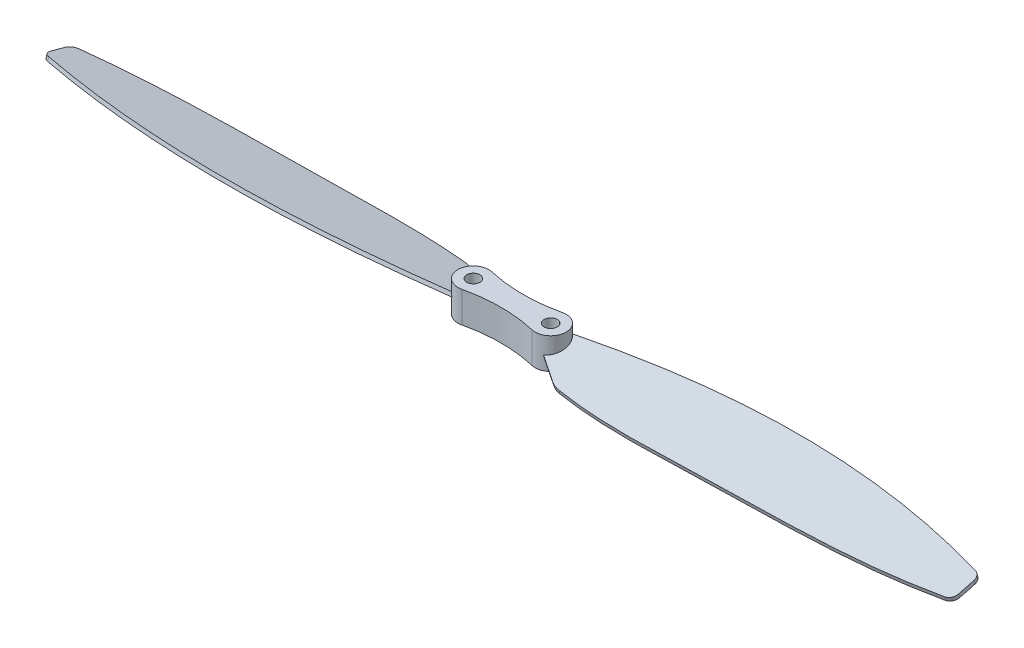
ISO-10303-21;
HEADER;
FILE_DESCRIPTION(('STEP AP214'),'2;1');
FILE_NAME('part.step','',(''),(''),'','','');
FILE_SCHEMA(('AUTOMOTIVE_DESIGN { 1 0 10303 214 1 1 1 1 }'));
ENDSEC;
DATA;
#1=APPLICATION_CONTEXT('core data for automotive mechanical design processes');
#2=APPLICATION_PROTOCOL_DEFINITION('international standard','automotive_design',2000,#1);
#3=PRODUCT_CONTEXT('',#1,'mechanical');
#4=PRODUCT('Part','Part','',(#3));
#5=PRODUCT_RELATED_PRODUCT_CATEGORY('part','',(#4));
#6=PRODUCT_DEFINITION_FORMATION('','',#4);
#7=PRODUCT_DEFINITION_CONTEXT('part definition',#1,'design');
#8=PRODUCT_DEFINITION('design','',#6,#7);
#9=PRODUCT_DEFINITION_SHAPE('','',#8);
#10=(LENGTH_UNIT() NAMED_UNIT(*) SI_UNIT(.MILLI.,.METRE.));
#11=(NAMED_UNIT(*) PLANE_ANGLE_UNIT() SI_UNIT($,.RADIAN.));
#12=(NAMED_UNIT(*) SI_UNIT($,.STERADIAN.) SOLID_ANGLE_UNIT());
#13=UNCERTAINTY_MEASURE_WITH_UNIT(LENGTH_MEASURE(1.E-05),#10,'distance_accuracy_value','');
#14=(GEOMETRIC_REPRESENTATION_CONTEXT(3) GLOBAL_UNCERTAINTY_ASSIGNED_CONTEXT((#13)) GLOBAL_UNIT_ASSIGNED_CONTEXT((#10,
#11,#12)) REPRESENTATION_CONTEXT('',''));
#15=CARTESIAN_POINT('',(0.,0.,0.));
#16=DIRECTION('',(0.,0.,1.));
#17=DIRECTION('',(1.,0.,0.));
#18=AXIS2_PLACEMENT_3D('',#15,#16,#17);
#19=CARTESIAN_POINT('',(-5.,4.,0.));
#20=DIRECTION('',(0.,-1.,0.));
#21=DIRECTION('',(0.,0.,-1.));
#22=AXIS2_PLACEMENT_3D('',#19,#20,#21);
#23=CYLINDRICAL_SURFACE('',#22,2.);
#24=CARTESIAN_POINT('',(-5.,0.,0.));
#25=DIRECTION('',(0.,1.,0.));
#26=DIRECTION('',(0.,0.,1.));
#27=AXIS2_PLACEMENT_3D('',#24,#25,#26);
#28=CIRCLE('',#27,2.);
#29=CARTESIAN_POINT('',(-4.54545454545454,0.,-1.9476622986935));
#30=VERTEX_POINT('',#29);
#31=CARTESIAN_POINT('',(-4.54545454545454,0.,1.9476622986935));
#32=VERTEX_POINT('',#31);
#33=EDGE_CURVE('E644',#30,#32,#28,.T.);
#34=ORIENTED_EDGE('',*,*,#33,.T.);
#35=DIRECTION('',(0.,-1.,0.));
#36=VECTOR('',#35,1.);
#37=CARTESIAN_POINT('',(-4.54545454545454,4.,1.9476622986935));
#38=LINE('',#37,#36);
#39=CARTESIAN_POINT('',(-4.54545454545454,4.,1.9476622986935));
#40=VERTEX_POINT('',#39);
#41=EDGE_CURVE('E660',#40,#32,#38,.T.);
#42=ORIENTED_EDGE('',*,*,#41,.F.);
#43=CARTESIAN_POINT('',(-5.,4.,0.));
#44=DIRECTION('',(0.,1.,0.));
#45=DIRECTION('',(0.,0.,1.));
#46=AXIS2_PLACEMENT_3D('',#43,#44,#45);
#47=CIRCLE('',#46,2.);
#48=CARTESIAN_POINT('',(-4.54545454545454,4.,-1.9476622986935));
#49=VERTEX_POINT('',#48);
#50=EDGE_CURVE('E641',#49,#40,#47,.T.);
#51=ORIENTED_EDGE('',*,*,#50,.F.);
#52=DIRECTION('',(0.,-1.,0.));
#53=VECTOR('',#52,1.);
#54=CARTESIAN_POINT('',(-4.54545454545454,4.,-1.9476622986935));
#55=LINE('',#54,#53);
#56=EDGE_CURVE('E656',#49,#30,#55,.T.);
#57=ORIENTED_EDGE('',*,*,#56,.T.);
#58=EDGE_LOOP('',(#34,#42,#51,#57));
#59=FACE_BOUND('',#58,.T.);
#60=CARTESIAN_POINT('',(-5.,1.74118095489748,0.));
#61=DIRECTION('',(0.,0.965925826289068,-0.258819045102522));
#62=DIRECTION('',(0.,-0.258819045102522,-0.965925826289068));
#63=AXIS2_PLACEMENT_3D('',#60,#61,#62);
#64=ELLIPSE('',#63,2.07055236082017,2.);
#65=CARTESIAN_POINT('',(-5.98774586559362,1.27519904277076,-1.73906817146503));
#66=VERTEX_POINT('',#65);
#67=CARTESIAN_POINT('',(-6.13282358889657,2.18282680138113,1.64824473802876));
#68=VERTEX_POINT('',#67);
#69=EDGE_CURVE('E11',#66,#68,#64,.T.);
#70=ORIENTED_EDGE('',*,*,#69,.F.);
#71=CARTESIAN_POINT('',(-5.,-2.78582998323562,0.));
#72=DIRECTION('',(-0.536981051107588,0.218338272370165,0.814849525722266));
#73=DIRECTION('',(-0.120142167420169,-0.975873146888678,0.182311438997044));
#74=AXIS2_PLACEMENT_3D('',#71,#72,#73);
#75=ELLIPSE('',#74,9.16009812796013,2.);
#76=CARTESIAN_POINT('',(-5.87434697016372,1.77684425741397,-1.79875439562091));
#77=VERTEX_POINT('',#76);
#78=EDGE_CURVE('E257',#77,#66,#75,.T.);
#79=ORIENTED_EDGE('',*,*,#78,.F.);
#80=CARTESIAN_POINT('',(-5.,2.25881904510252,0.));
#81=DIRECTION('',(0.,0.965925826289068,-0.258819045102522));
#82=DIRECTION('',(0.,-0.258819045102522,-0.965925826289068));
#83=AXIS2_PLACEMENT_3D('',#80,#81,#82);
#84=ELLIPSE('',#83,2.07055236082017,2.);
#85=CARTESIAN_POINT('',(-6.27033577564308,2.67273307916517,1.54474820508758));
#86=VERTEX_POINT('',#85);
#87=EDGE_CURVE('E750',#77,#86,#84,.T.);
#88=ORIENTED_EDGE('',*,*,#87,.T.);
#89=CARTESIAN_POINT('',(-6.13282358889657,2.18282680138114,1.64824473802876));
#90=CARTESIAN_POINT('',(-6.14506501810099,2.22347372736233,1.63983094072677));
#91=CARTESIAN_POINT('',(-6.15709835862117,2.26417127418118,1.63136011112619));
#92=CARTESIAN_POINT('',(-6.18076721990072,2.34565565178746,1.6143115509723));
#93=CARTESIAN_POINT('',(-6.19240277469154,2.38644247461787,1.60573382964993));
#94=CARTESIAN_POINT('',(-6.21529649060534,2.4681003337165,1.5884772228464));
#95=CARTESIAN_POINT('',(-6.2265546525425,2.50897136980283,1.57979833758355));
#96=CARTESIAN_POINT('',(-6.2487111845599,2.59079424338632,1.56234409025312));
#97=CARTESIAN_POINT('',(-6.25960952369611,2.63174608751353,1.55356871997408));
#98=CARTESIAN_POINT('',(-6.27033577564307,2.67273307916517,1.54474820508758));
#99=B_SPLINE_CURVE_WITH_KNOTS('',3,(#89,#90,#91,#92,#93,#94,#95,#96,#97,#98),.UNSPECIFIED.,.F.,
.F.,(4,2,2,2,4),(0.,0.129827276455146,0.2596434179636,0.389459279390435,0.519286275787984),.UNSPECIFIED.);
#100=EDGE_CURVE('E48',#68,#86,#99,.T.);
#101=ORIENTED_EDGE('',*,*,#100,.F.);
#102=EDGE_LOOP('',(#70,#79,#88,#101));
#103=FACE_BOUND('',#102,.T.);
#104=ADVANCED_FACE('F40',(#59,#103),#23,.T.);
#105=CARTESIAN_POINT('',(5.,4.,0.));
#106=DIRECTION('',(0.,-1.,0.));
#107=DIRECTION('',(0.,0.,-1.));
#108=AXIS2_PLACEMENT_3D('',#105,#106,#107);
#109=CYLINDRICAL_SURFACE('',#108,2.);
#110=CARTESIAN_POINT('',(5.,0.,0.));
#111=DIRECTION('',(0.,1.,0.));
#112=DIRECTION('',(0.,0.,1.));
#113=AXIS2_PLACEMENT_3D('',#110,#111,#112);
#114=CIRCLE('',#113,2.);
#115=CARTESIAN_POINT('',(4.54545454545454,0.,1.9476622986935));
#116=VERTEX_POINT('',#115);
#117=CARTESIAN_POINT('',(4.54545454545454,0.,-1.9476622986935));
#118=VERTEX_POINT('',#117);
#119=EDGE_CURVE('E666',#116,#118,#114,.T.);
#120=ORIENTED_EDGE('',*,*,#119,.T.);
#121=DIRECTION('',(0.,-1.,0.));
#122=VECTOR('',#121,1.);
#123=CARTESIAN_POINT('',(4.54545454545454,4.,-1.9476622986935));
#124=LINE('',#123,#122);
#125=CARTESIAN_POINT('',(4.54545454545454,4.,-1.9476622986935));
#126=VERTEX_POINT('',#125);
#127=EDGE_CURVE('E653',#126,#118,#124,.T.);
#128=ORIENTED_EDGE('',*,*,#127,.F.);
#129=CARTESIAN_POINT('',(5.,4.,0.));
#130=DIRECTION('',(0.,1.,0.));
#131=DIRECTION('',(0.,0.,1.));
#132=AXIS2_PLACEMENT_3D('',#129,#130,#131);
#133=CIRCLE('',#132,2.);
#134=CARTESIAN_POINT('',(4.54545454545454,4.,1.9476622986935));
#135=VERTEX_POINT('',#134);
#136=EDGE_CURVE('E638',#135,#126,#133,.T.);
#137=ORIENTED_EDGE('',*,*,#136,.F.);
#138=DIRECTION('',(0.,-1.,0.));
#139=VECTOR('',#138,1.);
#140=CARTESIAN_POINT('',(4.54545454545454,4.,1.9476622986935));
#141=LINE('',#140,#139);
#142=EDGE_CURVE('E648',#135,#116,#141,.T.);
#143=ORIENTED_EDGE('',*,*,#142,.T.);
#144=EDGE_LOOP('',(#120,#128,#137,#143));
#145=FACE_BOUND('',#144,.T.);
#146=CARTESIAN_POINT('',(5.,1.74118095489748,0.));
#147=DIRECTION('',(0.,0.965925826289068,0.258819045102522));
#148=DIRECTION('',(0.,-0.258819045102522,0.965925826289068));
#149=AXIS2_PLACEMENT_3D('',#146,#147,#148);
#150=ELLIPSE('',#149,2.07055236082017,2.);
#151=CARTESIAN_POINT('',(5.98774586559362,1.27519904277076,1.73906817146503));
#152=VERTEX_POINT('',#151);
#153=CARTESIAN_POINT('',(6.13282358889657,2.18282680138113,-1.64824473802876));
#154=VERTEX_POINT('',#153);
#155=EDGE_CURVE('E235',#152,#154,#150,.T.);
#156=ORIENTED_EDGE('',*,*,#155,.F.);
#157=CARTESIAN_POINT('',(5.,-2.78582998323562,0.));
#158=DIRECTION('',(0.536981051107588,0.218338272370165,-0.814849525722266));
#159=DIRECTION('',(0.120142167420169,-0.975873146888678,-0.182311438997044));
#160=AXIS2_PLACEMENT_3D('',#157,#158,#159);
#161=ELLIPSE('',#160,9.16009812796013,2.);
#162=CARTESIAN_POINT('',(5.87434697016372,1.77684425741397,1.79875439562091));
#163=VERTEX_POINT('',#162);
#164=EDGE_CURVE('E236',#163,#152,#161,.T.);
#165=ORIENTED_EDGE('',*,*,#164,.F.);
#166=CARTESIAN_POINT('',(5.,2.25881904510252,0.));
#167=DIRECTION('',(0.,0.965925826289068,0.258819045102522));
#168=DIRECTION('',(0.,-0.258819045102522,0.965925826289068));
#169=AXIS2_PLACEMENT_3D('',#166,#167,#168);
#170=ELLIPSE('',#169,2.07055236082017,2.);
#171=CARTESIAN_POINT('',(6.27033577564308,2.67273307916517,-1.54474820508758));
#172=VERTEX_POINT('',#171);
#173=EDGE_CURVE('E652',#163,#172,#170,.T.);
#174=ORIENTED_EDGE('',*,*,#173,.T.);
#175=CARTESIAN_POINT('',(6.13282358889657,2.18282680138114,-1.64824473802876));
#176=CARTESIAN_POINT('',(6.14506501810099,2.22347372736233,-1.63983094072677));
#177=CARTESIAN_POINT('',(6.15709835862117,2.26417127418118,-1.63136011112619));
#178=CARTESIAN_POINT('',(6.18076721990072,2.34565565178746,-1.6143115509723));
#179=CARTESIAN_POINT('',(6.19240277469154,2.38644247461787,-1.60573382964993));
#180=CARTESIAN_POINT('',(6.21529649060534,2.4681003337165,-1.5884772228464));
#181=CARTESIAN_POINT('',(6.2265546525425,2.50897136980283,-1.57979833758355));
#182=CARTESIAN_POINT('',(6.2487111845599,2.59079424338632,-1.56234409025312));
#183=CARTESIAN_POINT('',(6.25960952369611,2.63174608751353,-1.55356871997408));
#184=CARTESIAN_POINT('',(6.27033577564307,2.67273307916517,-1.54474820508758));
#185=B_SPLINE_CURVE_WITH_KNOTS('',3,(#175,#176,#177,#178,#179,#180,#181,#182,#183,#184),
.UNSPECIFIED.,.F.,.F.,(4,2,2,2,4),(0.,0.129827276455146,0.2596434179636,0.389459279390435,
0.519286275787984),.UNSPECIFIED.);
#186=EDGE_CURVE('E228',#154,#172,#185,.T.);
#187=ORIENTED_EDGE('',*,*,#186,.F.);
#188=EDGE_LOOP('',(#156,#165,#174,#187));
#189=FACE_BOUND('',#188,.T.);
#190=ADVANCED_FACE('F239',(#145,#189),#109,.T.);
#191=CARTESIAN_POINT('',(0.,4.,21.4242852856285));
#192=DIRECTION('',(0.,-1.,0.));
#193=DIRECTION('',(0.,0.,-1.));
#194=AXIS2_PLACEMENT_3D('',#191,#192,#193);
#195=CYLINDRICAL_SURFACE('',#194,20.);
#196=CARTESIAN_POINT('',(0.,0.,21.4242852856285));
#197=DIRECTION('',(0.,1.,0.));
#198=DIRECTION('',(0.,0.,1.));
#199=AXIS2_PLACEMENT_3D('',#196,#197,#198);
#200=CIRCLE('',#199,20.);
#201=EDGE_CURVE('E650',#32,#116,#200,.F.);
#202=ORIENTED_EDGE('',*,*,#201,.T.);
#203=ORIENTED_EDGE('',*,*,#142,.F.);
#204=CARTESIAN_POINT('',(0.,4.,21.4242852856285));
#205=DIRECTION('',(0.,1.,0.));
#206=DIRECTION('',(0.,0.,1.));
#207=AXIS2_PLACEMENT_3D('',#204,#205,#206);
#208=CIRCLE('',#207,20.);
#209=EDGE_CURVE('E635',#40,#135,#208,.F.);
#210=ORIENTED_EDGE('',*,*,#209,.F.);
#211=ORIENTED_EDGE('',*,*,#41,.T.);
#212=EDGE_LOOP('',(#202,#203,#210,#211));
#213=FACE_BOUND('',#212,.T.);
#214=ADVANCED_FACE('F42',(#213),#195,.F.);
#215=CARTESIAN_POINT('',(0.,4.,-21.4242852856285));
#216=DIRECTION('',(0.,-1.,0.));
#217=DIRECTION('',(0.,0.,-1.));
#218=AXIS2_PLACEMENT_3D('',#215,#216,#217);
#219=CYLINDRICAL_SURFACE('',#218,20.);
#220=CARTESIAN_POINT('',(0.,0.,-21.4242852856285));
#221=DIRECTION('',(0.,1.,0.));
#222=DIRECTION('',(0.,0.,1.));
#223=AXIS2_PLACEMENT_3D('',#220,#221,#222);
#224=CIRCLE('',#223,20.);
#225=EDGE_CURVE('E663',#30,#118,#224,.T.);
#226=ORIENTED_EDGE('',*,*,#225,.F.);
#227=ORIENTED_EDGE('',*,*,#56,.F.);
#228=CARTESIAN_POINT('',(0.,4.,-21.4242852856285));
#229=DIRECTION('',(0.,1.,0.));
#230=DIRECTION('',(0.,0.,1.));
#231=AXIS2_PLACEMENT_3D('',#228,#229,#230);
#232=CIRCLE('',#231,20.);
#233=EDGE_CURVE('E671',#49,#126,#232,.T.);
#234=ORIENTED_EDGE('',*,*,#233,.T.);
#235=ORIENTED_EDGE('',*,*,#127,.T.);
#236=EDGE_LOOP('',(#226,#227,#234,#235));
#237=FACE_BOUND('',#236,.T.);
#238=ADVANCED_FACE('F244',(#237),#219,.F.);
#239=CARTESIAN_POINT('',(0.,4.,0.));
#240=DIRECTION('',(0.,1.,0.));
#241=DIRECTION('',(0.,0.,1.));
#242=AXIS2_PLACEMENT_3D('',#239,#240,#241);
#243=PLANE('',#242);
#244=CARTESIAN_POINT('',(-5.,4.,0.));
#245=DIRECTION('',(0.,1.,0.));
#246=DIRECTION('',(0.,0.,1.));
#247=AXIS2_PLACEMENT_3D('',#244,#245,#246);
#248=CIRCLE('',#247,0.85);
#249=CARTESIAN_POINT('',(-5.,4.,0.85));
#250=VERTEX_POINT('',#249);
#251=EDGE_CURVE('E360',#250,#250,#248,.T.);
#252=ORIENTED_EDGE('',*,*,#251,.F.);
#253=EDGE_LOOP('',(#252));
#254=FACE_BOUND('',#253,.T.);
#255=CARTESIAN_POINT('',(5.,4.,0.));
#256=DIRECTION('',(0.,1.,0.));
#257=DIRECTION('',(0.,0.,1.));
#258=AXIS2_PLACEMENT_3D('',#255,#256,#257);
#259=CIRCLE('',#258,0.85);
#260=CARTESIAN_POINT('',(5.,4.,0.85));
#261=VERTEX_POINT('',#260);
#262=EDGE_CURVE('E365',#261,#261,#259,.T.);
#263=ORIENTED_EDGE('',*,*,#262,.F.);
#264=EDGE_LOOP('',(#263));
#265=FACE_BOUND('',#264,.T.);
#266=ORIENTED_EDGE('',*,*,#209,.T.);
#267=ORIENTED_EDGE('',*,*,#136,.T.);
#268=ORIENTED_EDGE('',*,*,#233,.F.);
#269=ORIENTED_EDGE('',*,*,#50,.T.);
#270=EDGE_LOOP('',(#266,#267,#268,#269));
#271=FACE_BOUND('',#270,.T.);
#272=ADVANCED_FACE('F225',(#254,#265,#271),#243,.T.);
#273=CARTESIAN_POINT('',(0.,0.,0.));
#274=DIRECTION('',(0.,1.,0.));
#275=DIRECTION('',(0.,0.,1.));
#276=AXIS2_PLACEMENT_3D('',#273,#274,#275);
#277=PLANE('',#276);
#278=CARTESIAN_POINT('',(-5.,0.,0.));
#279=DIRECTION('',(0.,1.,0.));
#280=DIRECTION('',(0.,0.,1.));
#281=AXIS2_PLACEMENT_3D('',#278,#279,#280);
#282=CIRCLE('',#281,0.85);
#283=CARTESIAN_POINT('',(-5.,0.,0.85));
#284=VERTEX_POINT('',#283);
#285=EDGE_CURVE('E355',#284,#284,#282,.T.);
#286=ORIENTED_EDGE('',*,*,#285,.T.);
#287=EDGE_LOOP('',(#286));
#288=FACE_BOUND('',#287,.T.);
#289=CARTESIAN_POINT('',(5.,0.,0.));
#290=DIRECTION('',(0.,1.,0.));
#291=DIRECTION('',(0.,0.,1.));
#292=AXIS2_PLACEMENT_3D('',#289,#290,#291);
#293=CIRCLE('',#292,0.85);
#294=CARTESIAN_POINT('',(5.,0.,0.85));
#295=VERTEX_POINT('',#294);
#296=EDGE_CURVE('E270',#295,#295,#293,.T.);
#297=ORIENTED_EDGE('',*,*,#296,.T.);
#298=EDGE_LOOP('',(#297));
#299=FACE_BOUND('',#298,.T.);
#300=ORIENTED_EDGE('',*,*,#201,.F.);
#301=ORIENTED_EDGE('',*,*,#33,.F.);
#302=ORIENTED_EDGE('',*,*,#225,.T.);
#303=ORIENTED_EDGE('',*,*,#119,.F.);
#304=EDGE_LOOP('',(#300,#301,#302,#303));
#305=FACE_BOUND('',#304,.T.);
#306=ADVANCED_FACE('F222',(#288,#299,#305),#277,.F.);
#307=CARTESIAN_POINT('',(5.,2.12454394721217,-1.43073016506007));
#308=CARTESIAN_POINT('',(23.0551671465473,3.06874516411303,-4.95453707910242));
#309=CARTESIAN_POINT('',(40.7679372398161,3.2697667907803,-5.70476000324478));
#310=CARTESIAN_POINT('',(58.7391343275857,2.0933879485083,-1.31445439493665));
#311=B_SPLINE_CURVE_WITH_KNOTS('',3,(#307,#308,#309,#310),.UNSPECIFIED.,.F.,.F.,(4,4),(0.,
0.986483200621647),.UNSPECIFIED.);
#312=DIRECTION('',(0.,0.965925826289068,0.258819045102522));
#313=VECTOR('',#312,1.);
#314=SURFACE_OF_LINEAR_EXTRUSION('',#311,#313);
#315=CARTESIAN_POINT('',(58.7391343275857,2.0933879485083,-1.31445439493666));
#316=VERTEX_POINT('',#315);
#317=EDGE_CURVE('E204',#154,#316,#311,.T.);
#318=ORIENTED_EDGE('',*,*,#317,.F.);
#319=ORIENTED_EDGE('',*,*,#186,.T.);
#320=CARTESIAN_POINT('',(5.,2.60750686035671,-1.3013206425088));
#321=CARTESIAN_POINT('',(23.0551671465473,3.55170807725757,-4.82512755655116));
#322=CARTESIAN_POINT('',(40.7679372398161,3.75272970392483,-5.57535048069352));
#323=CARTESIAN_POINT('',(58.7391343275857,2.57635086165283,-1.18504487238539));
#324=B_SPLINE_CURVE_WITH_KNOTS('',3,(#320,#321,#322,#323),.UNSPECIFIED.,.F.,.F.,(4,4),(0.,
0.986483200621647),.UNSPECIFIED.);
#325=CARTESIAN_POINT('',(58.7391343275857,2.57635086165283,-1.1850448723854));
#326=VERTEX_POINT('',#325);
#327=EDGE_CURVE('E63',#172,#326,#324,.T.);
#328=ORIENTED_EDGE('',*,*,#327,.T.);
#329=DIRECTION('',(0.,0.965925826289068,0.258819045102522));
#330=VECTOR('',#329,1.);
#331=CARTESIAN_POINT('',(58.7391343275857,2.0933879485083,-1.31445439493666));
#332=LINE('',#331,#330);
#333=EDGE_CURVE('E669',#316,#326,#332,.T.);
#334=ORIENTED_EDGE('',*,*,#333,.F.);
#335=EDGE_LOOP('',(#318,#319,#328,#334));
#336=FACE_BOUND('',#335,.T.);
#337=ADVANCED_FACE('F216',(#336),#314,.F.);
#338=CARTESIAN_POINT('',(58.4939401629709,1.8424696155838,-0.378014427911937));
#339=DIRECTION('',(0.,0.965925826289068,0.258819045102522));
#340=DIRECTION('',(0.,-0.258819045102522,0.965925826289068));
#341=AXIS2_PLACEMENT_3D('',#338,#339,#340);
#342=CYLINDRICAL_SURFACE('',#341,1.);
#343=CARTESIAN_POINT('',(58.4939401629709,2.32543252872833,-0.248604905360676));
#344=DIRECTION('',(0.,-0.965925826289068,-0.258819045102522));
#345=DIRECTION('',(0.,0.258819045102522,-0.965925826289068));
#346=AXIS2_PLACEMENT_3D('',#343,#344,#345);
#347=CIRCLE('',#346,1.);
#348=CARTESIAN_POINT('',(59.4938365760131,2.3291577538287,-0.262507634704898));
#349=VERTEX_POINT('',#348);
#350=EDGE_CURVE('E198',#326,#349,#347,.T.);
#351=ORIENTED_EDGE('',*,*,#350,.T.);
#352=DIRECTION('',(0.,0.965925826289068,0.258819045102522));
#353=VECTOR('',#352,1.);
#354=CARTESIAN_POINT('',(59.4938365760131,1.84619484068417,-0.391917157256159));
#355=LINE('',#354,#353);
#356=CARTESIAN_POINT('',(59.4938365760131,1.84619484068417,-0.391917157256159));
#357=VERTEX_POINT('',#356);
#358=EDGE_CURVE('E677',#357,#349,#355,.T.);
#359=ORIENTED_EDGE('',*,*,#358,.F.);
#360=CARTESIAN_POINT('',(58.4939401629709,1.8424696155838,-0.378014427911937));
#361=DIRECTION('',(0.,-0.965925826289068,-0.258819045102522));
#362=DIRECTION('',(0.,0.258819045102522,-0.965925826289068));
#363=AXIS2_PLACEMENT_3D('',#360,#361,#362);
#364=CIRCLE('',#363,1.);
#365=EDGE_CURVE('E209',#316,#357,#364,.T.);
#366=ORIENTED_EDGE('',*,*,#365,.F.);
#367=ORIENTED_EDGE('',*,*,#333,.T.);
#368=EDGE_LOOP('',(#351,#359,#366,#367));
#369=FACE_BOUND('',#368,.T.);
#370=ADVANCED_FACE('F221',(#369),#342,.T.);
#371=CARTESIAN_POINT('',(0.,1.62454394721217,0.435295238724372));
#372=DIRECTION('',(0.,0.965925826289068,0.258819045102522));
#373=DIRECTION('',(0.,-0.258819045102522,0.965925826289068));
#374=AXIS2_PLACEMENT_3D('',#371,#372,#373);
#375=CYLINDRICAL_SURFACE('',#374,59.5);
#376=CARTESIAN_POINT('',(0.,2.10750686035671,0.564704761275633));
#377=DIRECTION('',(0.,-0.965925826289068,-0.258819045102522));
#378=DIRECTION('',(0.,0.258819045102522,-0.965925826289068));
#379=AXIS2_PLACEMENT_3D('',#376,#377,#378);
#380=CIRCLE('',#379,59.5);
#381=CARTESIAN_POINT('',(59.4868850066075,1.78418891056721,1.77134377688902));
#382=VERTEX_POINT('',#381);
#383=EDGE_CURVE('E706',#349,#382,#380,.T.);
#384=ORIENTED_EDGE('',*,*,#383,.T.);
#385=DIRECTION('',(0.,0.965925826289068,0.258819045102522));
#386=VECTOR('',#385,1.);
#387=CARTESIAN_POINT('',(59.4868850066075,1.30122599742268,1.64193425433776));
#388=LINE('',#387,#386);
#389=CARTESIAN_POINT('',(59.4868850066075,1.30122599742268,1.64193425433776));
#390=VERTEX_POINT('',#389);
#391=EDGE_CURVE('E680',#390,#382,#388,.T.);
#392=ORIENTED_EDGE('',*,*,#391,.F.);
#393=CARTESIAN_POINT('',(0.,1.62454394721217,0.435295238724372));
#394=DIRECTION('',(0.,-0.965925826289068,-0.258819045102522));
#395=DIRECTION('',(0.,0.258819045102522,-0.965925826289068));
#396=AXIS2_PLACEMENT_3D('',#393,#394,#395);
#397=CIRCLE('',#396,59.5);
#398=EDGE_CURVE('E727',#357,#390,#397,.T.);
#399=ORIENTED_EDGE('',*,*,#398,.F.);
#400=ORIENTED_EDGE('',*,*,#358,.T.);
#401=EDGE_LOOP('',(#384,#392,#399,#400));
#402=FACE_BOUND('',#401,.T.);
#403=ADVANCED_FACE('F488',(#402),#375,.T.);
#404=CARTESIAN_POINT('',(58.4871054266645,1.30665991254518,1.62165460701656));
#405=DIRECTION('',(0.,0.965925826289068,0.258819045102522));
#406=DIRECTION('',(0.,-0.258819045102522,0.965925826289068));
#407=AXIS2_PLACEMENT_3D('',#404,#405,#406);
#408=CYLINDRICAL_SURFACE('',#407,0.999999999999999);
#409=CARTESIAN_POINT('',(58.4871054266645,1.78962282568972,1.75106412956782));
#410=DIRECTION('',(0.,-0.965925826289068,-0.258819045102522));
#411=DIRECTION('',(0.,-0.258819045102522,0.965925826289068));
#412=AXIS2_PLACEMENT_3D('',#409,#410,#411);
#413=CIRCLE('',#412,0.999999999999999);
#414=CARTESIAN_POINT('',(58.654900348896,1.5344733369107,2.70329498521634));
#415=VERTEX_POINT('',#414);
#416=EDGE_CURVE('E701',#382,#415,#413,.T.);
#417=ORIENTED_EDGE('',*,*,#416,.T.);
#418=DIRECTION('',(0.,0.965925826289068,0.258819045102522));
#419=VECTOR('',#418,1.);
#420=CARTESIAN_POINT('',(58.654900348896,1.05151042376616,2.57388546266508));
#421=LINE('',#420,#419);
#422=CARTESIAN_POINT('',(58.654900348896,1.05151042376616,2.57388546266508));
#423=VERTEX_POINT('',#422);
#424=EDGE_CURVE('E683',#423,#415,#421,.T.);
#425=ORIENTED_EDGE('',*,*,#424,.F.);
#426=CARTESIAN_POINT('',(58.4871054266645,1.30665991254518,1.62165460701656));
#427=DIRECTION('',(0.,-0.965925826289068,-0.258819045102522));
#428=DIRECTION('',(0.,-0.258819045102522,0.965925826289068));
#429=AXIS2_PLACEMENT_3D('',#426,#427,#428);
#430=CIRCLE('',#429,0.999999999999999);
#431=EDGE_CURVE('E723',#390,#423,#430,.T.);
#432=ORIENTED_EDGE('',*,*,#431,.F.);
#433=ORIENTED_EDGE('',*,*,#391,.T.);
#434=EDGE_LOOP('',(#417,#425,#432,#433));
#435=FACE_BOUND('',#434,.T.);
#436=ADVANCED_FACE('F477',(#435),#408,.T.);
#437=CARTESIAN_POINT('',(58.654900348896,1.05151042376616,2.57388546266508));
#438=CARTESIAN_POINT('',(48.1454560871373,0.588536720452,4.30172684600185));
#439=CARTESIAN_POINT('',(32.2615865963093,0.668170539250832,4.00452938824387));
#440=CARTESIAN_POINT('',(16.3692005430732,0.453273626028743,4.80653558677843));
#441=CARTESIAN_POINT('',(10.1721814333079,0.670475252130272,3.99592808268095));
#442=B_SPLINE_CURVE_WITH_KNOTS('',3,(#437,#438,#439,#440,#441),.UNSPECIFIED.,.F.,.F.,(4,1,4),
(0.0166113802362709,0.626326747169096,0.984355773505589),.UNSPECIFIED.);
#443=DIRECTION('',(0.,0.965925826289068,0.258819045102522));
#444=VECTOR('',#443,1.);
#445=SURFACE_OF_LINEAR_EXTRUSION('',#442,#444);
#446=CARTESIAN_POINT('',(58.654900348896,1.5344733369107,2.70329498521634));
#447=CARTESIAN_POINT('',(48.1454560871373,1.07149963359653,4.43113636855311));
#448=CARTESIAN_POINT('',(32.2615865963093,1.15113345239537,4.13393891079513));
#449=CARTESIAN_POINT('',(16.3692005430732,0.936236539173277,4.93594510932969));
#450=CARTESIAN_POINT('',(10.1721814333079,1.15343816527481,4.12533760523221));
#451=B_SPLINE_CURVE_WITH_KNOTS('',3,(#446,#447,#448,#449,#450),.UNSPECIFIED.,.F.,.F.,(4,1,4),
(0.0166113802362709,0.626326747169096,0.984355773505589),.UNSPECIFIED.);
#452=CARTESIAN_POINT('',(10.1721814333079,1.15343816527481,4.12533760523221));
#453=VERTEX_POINT('',#452);
#454=EDGE_CURVE('E697',#415,#453,#451,.T.);
#455=ORIENTED_EDGE('',*,*,#454,.T.);
#456=DIRECTION('',(0.,0.965925826289068,0.258819045102522));
#457=VECTOR('',#456,1.);
#458=CARTESIAN_POINT('',(10.1721814333079,0.670475252130272,3.99592808268095));
#459=LINE('',#458,#457);
#460=CARTESIAN_POINT('',(10.1721814333079,0.670475252130272,3.99592808268095));
#461=VERTEX_POINT('',#460);
#462=EDGE_CURVE('E686',#461,#453,#459,.T.);
#463=ORIENTED_EDGE('',*,*,#462,.F.);
#464=EDGE_CURVE('E718',#423,#461,#442,.T.);
#465=ORIENTED_EDGE('',*,*,#464,.F.);
#466=ORIENTED_EDGE('',*,*,#424,.T.);
#467=EDGE_LOOP('',(#455,#463,#465,#466));
#468=FACE_BOUND('',#467,.T.);
#469=ADVANCED_FACE('F466',(#468),#445,.F.);
#470=CARTESIAN_POINT('',(10.5747678721749,1.43990923910316,1.12436135022785));
#471=DIRECTION('',(0.,0.965925826289068,0.258819045102522));
#472=DIRECTION('',(0.,-0.258819045102522,0.965925826289068));
#473=AXIS2_PLACEMENT_3D('',#470,#471,#472);
#474=CYLINDRICAL_SURFACE('',#473,3.);
#475=CARTESIAN_POINT('',(10.5747678721749,1.92287215224769,1.25377087277911));
#476=DIRECTION('',(0.,-0.965925826289068,-0.258819045102522));
#477=DIRECTION('',(0.,-0.258819045102522,0.965925826289068));
#478=AXIS2_PLACEMENT_3D('',#475,#476,#477);
#479=CIRCLE('',#478,3.);
#480=CARTESIAN_POINT('',(8.96382471885218,1.2678573351372,3.69831944994591));
#481=VERTEX_POINT('',#480);
#482=EDGE_CURVE('E695',#453,#481,#479,.T.);
#483=ORIENTED_EDGE('',*,*,#482,.T.);
#484=DIRECTION('',(0.,0.965925826289068,0.258819045102522));
#485=VECTOR('',#484,1.);
#486=CARTESIAN_POINT('',(8.96382471885218,0.784894421992664,3.56890992739465));
#487=LINE('',#486,#485);
#488=CARTESIAN_POINT('',(8.96382471885218,0.784894421992664,3.56890992739465));
#489=VERTEX_POINT('',#488);
#490=EDGE_CURVE('E689',#489,#481,#487,.T.);
#491=ORIENTED_EDGE('',*,*,#490,.F.);
#492=CARTESIAN_POINT('',(10.5747678721749,1.43990923910316,1.12436135022785));
#493=DIRECTION('',(0.,-0.965925826289068,-0.258819045102522));
#494=DIRECTION('',(0.,-0.258819045102522,0.965925826289068));
#495=AXIS2_PLACEMENT_3D('',#492,#493,#494);
#496=CIRCLE('',#495,3.);
#497=EDGE_CURVE('E716',#461,#489,#496,.T.);
#498=ORIENTED_EDGE('',*,*,#497,.F.);
#499=ORIENTED_EDGE('',*,*,#462,.T.);
#500=EDGE_LOOP('',(#483,#491,#498,#499));
#501=FACE_BOUND('',#500,.T.);
#502=ADVANCED_FACE('F455',(#501),#474,.T.);
#503=CARTESIAN_POINT('',(5.,1.43792872364757,1.13175273453328));
#504=DIRECTION('',(0.536981051107588,0.218338272370165,-0.814849525722266));
#505=DIRECTION('',(-0.834995335531267,0.,-0.550257021437279));
#506=AXIS2_PLACEMENT_3D('',#503,#504,#505);
#507=PLANE('',#506);
#508=DIRECTION('',(-0.843594304598715,0.138980922885814,-0.518683865492669));
#509=VECTOR('',#508,1.);
#510=CARTESIAN_POINT('',(5.,1.92089163679211,1.26116225708454));
#511=LINE('',#510,#509);
#512=EDGE_CURVE('E210',#481,#163,#511,.T.);
#513=ORIENTED_EDGE('',*,*,#512,.T.);
#514=ORIENTED_EDGE('',*,*,#164,.T.);
#515=DIRECTION('',(-0.843594304598715,0.138980922885814,-0.518683865492669));
#516=VECTOR('',#515,1.);
#517=CARTESIAN_POINT('',(5.,1.43792872364757,1.13175273453328));
#518=LINE('',#517,#516);
#519=EDGE_CURVE('E692',#489,#152,#518,.T.);
#520=ORIENTED_EDGE('',*,*,#519,.F.);
#521=ORIENTED_EDGE('',*,*,#490,.T.);
#522=EDGE_LOOP('',(#513,#514,#520,#521));
#523=FACE_BOUND('',#522,.T.);
#524=ADVANCED_FACE('F445',(#523),#507,.F.);
#525=CARTESIAN_POINT('',(31.9010559358345,2.90418347005006,-4.34038447587979));
#526=DIRECTION('',(0.,0.965925826289068,0.258819045102522));
#527=DIRECTION('',(0.,-0.258819045102522,0.965925826289068));
#528=AXIS2_PLACEMENT_3D('',#525,#526,#527);
#529=PLANE('',#528);
#530=ORIENTED_EDGE('',*,*,#519,.T.);
#531=ORIENTED_EDGE('',*,*,#155,.T.);
#532=ORIENTED_EDGE('',*,*,#317,.T.);
#533=ORIENTED_EDGE('',*,*,#365,.T.);
#534=ORIENTED_EDGE('',*,*,#398,.T.);
#535=ORIENTED_EDGE('',*,*,#431,.T.);
#536=ORIENTED_EDGE('',*,*,#464,.T.);
#537=ORIENTED_EDGE('',*,*,#497,.T.);
#538=EDGE_LOOP('',(#530,#531,#532,#533,#534,#535,#536,#537));
#539=FACE_BOUND('',#538,.T.);
#540=ADVANCED_FACE('F264',(#539),#529,.F.);
#541=CARTESIAN_POINT('',(31.9010559358345,3.38714638319459,-4.21097495332853));
#542=DIRECTION('',(0.,0.965925826289068,0.258819045102522));
#543=DIRECTION('',(0.,-0.258819045102522,0.965925826289068));
#544=AXIS2_PLACEMENT_3D('',#541,#542,#543);
#545=PLANE('',#544);
#546=ORIENTED_EDGE('',*,*,#173,.F.);
#547=ORIENTED_EDGE('',*,*,#512,.F.);
#548=ORIENTED_EDGE('',*,*,#482,.F.);
#549=ORIENTED_EDGE('',*,*,#454,.F.);
#550=ORIENTED_EDGE('',*,*,#416,.F.);
#551=ORIENTED_EDGE('',*,*,#383,.F.);
#552=ORIENTED_EDGE('',*,*,#350,.F.);
#553=ORIENTED_EDGE('',*,*,#327,.F.);
#554=EDGE_LOOP('',(#546,#547,#548,#549,#550,#551,#552,#553));
#555=FACE_BOUND('',#554,.T.);
#556=ADVANCED_FACE('F262',(#555),#545,.T.);
#557=CARTESIAN_POINT('',(-5.,2.12454394721217,1.43073016506007));
#558=CARTESIAN_POINT('',(-23.0551671465473,3.06874516411303,4.95453707910242));
#559=CARTESIAN_POINT('',(-40.7679372398161,3.2697667907803,5.70476000324478));
#560=CARTESIAN_POINT('',(-58.7391343275857,2.0933879485083,1.31445439493665));
#561=B_SPLINE_CURVE_WITH_KNOTS('',3,(#557,#558,#559,#560),.UNSPECIFIED.,.F.,.F.,(4,4),(0.,
0.986483200621647),.UNSPECIFIED.);
#562=DIRECTION('',(0.,0.965925826289068,-0.258819045102522));
#563=VECTOR('',#562,1.);
#564=SURFACE_OF_LINEAR_EXTRUSION('',#561,#563);
#565=CARTESIAN_POINT('',(-58.7391343275857,2.0933879485083,1.31445439493666));
#566=VERTEX_POINT('',#565);
#567=EDGE_CURVE('E175',#68,#566,#561,.T.);
#568=ORIENTED_EDGE('',*,*,#567,.F.);
#569=ORIENTED_EDGE('',*,*,#100,.T.);
#570=CARTESIAN_POINT('',(-5.,2.60750686035671,1.3013206425088));
#571=CARTESIAN_POINT('',(-23.0551671465473,3.55170807725757,4.82512755655116));
#572=CARTESIAN_POINT('',(-40.7679372398161,3.75272970392483,5.57535048069352));
#573=CARTESIAN_POINT('',(-58.7391343275857,2.57635086165283,1.18504487238539));
#574=B_SPLINE_CURVE_WITH_KNOTS('',3,(#570,#571,#572,#573),.UNSPECIFIED.,.F.,.F.,(4,4),(0.,
0.986483200621647),.UNSPECIFIED.);
#575=CARTESIAN_POINT('',(-58.7391343275857,2.57635086165283,1.1850448723854));
#576=VERTEX_POINT('',#575);
#577=EDGE_CURVE('E55',#86,#576,#574,.T.);
#578=ORIENTED_EDGE('',*,*,#577,.T.);
#579=DIRECTION('',(0.,0.965925826289068,-0.258819045102522));
#580=VECTOR('',#579,1.);
#581=CARTESIAN_POINT('',(-58.7391343275857,2.0933879485083,1.31445439493666));
#582=LINE('',#581,#580);
#583=EDGE_CURVE('E190',#566,#576,#582,.T.);
#584=ORIENTED_EDGE('',*,*,#583,.F.);
#585=EDGE_LOOP('',(#568,#569,#578,#584));
#586=FACE_BOUND('',#585,.T.);
#587=ADVANCED_FACE('F196',(#586),#564,.F.);
#588=CARTESIAN_POINT('',(-58.4939401629709,1.8424696155838,0.378014427911937));
#589=DIRECTION('',(0.,0.965925826289068,-0.258819045102522));
#590=DIRECTION('',(0.,0.258819045102522,0.965925826289068));
#591=AXIS2_PLACEMENT_3D('',#588,#589,#590);
#592=CYLINDRICAL_SURFACE('',#591,1.);
#593=CARTESIAN_POINT('',(-58.4939401629709,2.32543252872833,0.248604905360676));
#594=DIRECTION('',(0.,-0.965925826289068,0.258819045102522));
#595=DIRECTION('',(0.,0.258819045102522,0.965925826289068));
#596=AXIS2_PLACEMENT_3D('',#593,#594,#595);
#597=CIRCLE('',#596,1.);
#598=CARTESIAN_POINT('',(-59.4938365760131,2.3291577538287,0.262507634704898));
#599=VERTEX_POINT('',#598);
#600=EDGE_CURVE('E313',#576,#599,#597,.T.);
#601=ORIENTED_EDGE('',*,*,#600,.T.);
#602=DIRECTION('',(0.,0.965925826289068,-0.258819045102522));
#603=VECTOR('',#602,1.);
#604=CARTESIAN_POINT('',(-59.4938365760131,1.84619484068417,0.391917157256159));
#605=LINE('',#604,#603);
#606=CARTESIAN_POINT('',(-59.4938365760131,1.84619484068417,0.391917157256159));
#607=VERTEX_POINT('',#606);
#608=EDGE_CURVE('E192',#607,#599,#605,.T.);
#609=ORIENTED_EDGE('',*,*,#608,.F.);
#610=CARTESIAN_POINT('',(-58.4939401629709,1.8424696155838,0.378014427911937));
#611=DIRECTION('',(0.,-0.965925826289068,0.258819045102522));
#612=DIRECTION('',(0.,0.258819045102522,0.965925826289068));
#613=AXIS2_PLACEMENT_3D('',#610,#611,#612);
#614=CIRCLE('',#613,1.);
#615=EDGE_CURVE('E179',#566,#607,#614,.T.);
#616=ORIENTED_EDGE('',*,*,#615,.F.);
#617=ORIENTED_EDGE('',*,*,#583,.T.);
#618=EDGE_LOOP('',(#601,#609,#616,#617));
#619=FACE_BOUND('',#618,.T.);
#620=ADVANCED_FACE('F189',(#619),#592,.T.);
#621=CARTESIAN_POINT('',(0.,1.62454394721217,-0.435295238724372));
#622=DIRECTION('',(0.,0.965925826289068,-0.258819045102522));
#623=DIRECTION('',(0.,0.258819045102522,0.965925826289068));
#624=AXIS2_PLACEMENT_3D('',#621,#622,#623);
#625=CYLINDRICAL_SURFACE('',#624,59.5);
#626=CARTESIAN_POINT('',(0.,2.10750686035671,-0.564704761275633));
#627=DIRECTION('',(0.,-0.965925826289068,0.258819045102522));
#628=DIRECTION('',(0.,0.258819045102522,0.965925826289068));
#629=AXIS2_PLACEMENT_3D('',#626,#627,#628);
#630=CIRCLE('',#629,59.5);
#631=CARTESIAN_POINT('',(-59.4868850066075,1.78418891056721,-1.77134377688902));
#632=VERTEX_POINT('',#631);
#633=EDGE_CURVE('E308',#599,#632,#630,.T.);
#634=ORIENTED_EDGE('',*,*,#633,.T.);
#635=DIRECTION('',(0.,0.965925826289068,-0.258819045102522));
#636=VECTOR('',#635,1.);
#637=CARTESIAN_POINT('',(-59.4868850066075,1.30122599742268,-1.64193425433776));
#638=LINE('',#637,#636);
#639=CARTESIAN_POINT('',(-59.4868850066075,1.30122599742268,-1.64193425433776));
#640=VERTEX_POINT('',#639);
#641=EDGE_CURVE('E200',#640,#632,#638,.T.);
#642=ORIENTED_EDGE('',*,*,#641,.F.);
#643=CARTESIAN_POINT('',(0.,1.62454394721217,-0.435295238724372));
#644=DIRECTION('',(0.,-0.965925826289068,0.258819045102522));
#645=DIRECTION('',(0.,0.258819045102522,0.965925826289068));
#646=AXIS2_PLACEMENT_3D('',#643,#644,#645);
#647=CIRCLE('',#646,59.5);
#648=EDGE_CURVE('E194',#607,#640,#647,.T.);
#649=ORIENTED_EDGE('',*,*,#648,.F.);
#650=ORIENTED_EDGE('',*,*,#608,.T.);
#651=EDGE_LOOP('',(#634,#642,#649,#650));
#652=FACE_BOUND('',#651,.T.);
#653=ADVANCED_FACE('F299',(#652),#625,.T.);
#654=CARTESIAN_POINT('',(-58.4871054266645,1.30665991254518,-1.62165460701656));
#655=DIRECTION('',(0.,0.965925826289068,-0.258819045102522));
#656=DIRECTION('',(0.,0.258819045102522,0.965925826289068));
#657=AXIS2_PLACEMENT_3D('',#654,#655,#656);
#658=CYLINDRICAL_SURFACE('',#657,0.999999999999999);
#659=CARTESIAN_POINT('',(-58.4871054266645,1.78962282568972,-1.75106412956782));
#660=DIRECTION('',(0.,-0.965925826289068,0.258819045102522));
#661=DIRECTION('',(0.,-0.258819045102522,-0.965925826289068));
#662=AXIS2_PLACEMENT_3D('',#659,#660,#661);
#663=CIRCLE('',#662,0.999999999999999);
#664=CARTESIAN_POINT('',(-58.654900348896,1.5344733369107,-2.70329498521634));
#665=VERTEX_POINT('',#664);
#666=EDGE_CURVE('E312',#632,#665,#663,.T.);
#667=ORIENTED_EDGE('',*,*,#666,.T.);
#668=DIRECTION('',(0.,0.965925826289068,-0.258819045102522));
#669=VECTOR('',#668,1.);
#670=CARTESIAN_POINT('',(-58.654900348896,1.05151042376616,-2.57388546266508));
#671=LINE('',#670,#669);
#672=CARTESIAN_POINT('',(-58.654900348896,1.05151042376616,-2.57388546266508));
#673=VERTEX_POINT('',#672);
#674=EDGE_CURVE('E317',#673,#665,#671,.T.);
#675=ORIENTED_EDGE('',*,*,#674,.F.);
#676=CARTESIAN_POINT('',(-58.4871054266645,1.30665991254518,-1.62165460701656));
#677=DIRECTION('',(0.,-0.965925826289068,0.258819045102522));
#678=DIRECTION('',(0.,-0.258819045102522,-0.965925826289068));
#679=AXIS2_PLACEMENT_3D('',#676,#677,#678);
#680=CIRCLE('',#679,0.999999999999999);
#681=EDGE_CURVE('E277',#640,#673,#680,.T.);
#682=ORIENTED_EDGE('',*,*,#681,.F.);
#683=ORIENTED_EDGE('',*,*,#641,.T.);
#684=EDGE_LOOP('',(#667,#675,#682,#683));
#685=FACE_BOUND('',#684,.T.);
#686=ADVANCED_FACE('F295',(#685),#658,.T.);
#687=CARTESIAN_POINT('',(-58.654900348896,1.05151042376616,-2.57388546266508));
#688=CARTESIAN_POINT('',(-48.1454560871373,0.588536720452,-4.30172684600185));
#689=CARTESIAN_POINT('',(-32.2615865963093,0.668170539250832,-4.00452938824387));
#690=CARTESIAN_POINT('',(-16.3692005430732,0.453273626028743,-4.80653558677843));
#691=CARTESIAN_POINT('',(-10.1721814333079,0.670475252130272,-3.99592808268095));
#692=B_SPLINE_CURVE_WITH_KNOTS('',3,(#687,#688,#689,#690,#691),.UNSPECIFIED.,.F.,.F.,(4,1,4),
(0.0166113802362709,0.626326747169096,0.984355773505589),.UNSPECIFIED.);
#693=DIRECTION('',(0.,0.965925826289068,-0.258819045102522));
#694=VECTOR('',#693,1.);
#695=SURFACE_OF_LINEAR_EXTRUSION('',#692,#694);
#696=CARTESIAN_POINT('',(-58.654900348896,1.5344733369107,-2.70329498521634));
#697=CARTESIAN_POINT('',(-48.1454560871373,1.07149963359653,-4.43113636855311));
#698=CARTESIAN_POINT('',(-32.2615865963093,1.15113345239537,-4.13393891079513));
#699=CARTESIAN_POINT('',(-16.3692005430732,0.936236539173277,-4.93594510932969));
#700=CARTESIAN_POINT('',(-10.1721814333079,1.15343816527481,-4.12533760523221));
#701=B_SPLINE_CURVE_WITH_KNOTS('',3,(#696,#697,#698,#699,#700),.UNSPECIFIED.,.F.,.F.,(4,1,4),
(0.0166113802362709,0.626326747169096,0.984355773505589),.UNSPECIFIED.);
#702=CARTESIAN_POINT('',(-10.1721814333079,1.15343816527481,-4.12533760523221));
#703=VERTEX_POINT('',#702);
#704=EDGE_CURVE('E321',#665,#703,#701,.T.);
#705=ORIENTED_EDGE('',*,*,#704,.T.);
#706=DIRECTION('',(0.,0.965925826289068,-0.258819045102522));
#707=VECTOR('',#706,1.);
#708=CARTESIAN_POINT('',(-10.1721814333079,0.670475252130272,-3.99592808268095));
#709=LINE('',#708,#707);
#710=CARTESIAN_POINT('',(-10.1721814333079,0.670475252130272,-3.99592808268095));
#711=VERTEX_POINT('',#710);
#712=EDGE_CURVE('E338',#711,#703,#709,.T.);
#713=ORIENTED_EDGE('',*,*,#712,.F.);
#714=EDGE_CURVE('E279',#673,#711,#692,.T.);
#715=ORIENTED_EDGE('',*,*,#714,.F.);
#716=ORIENTED_EDGE('',*,*,#674,.T.);
#717=EDGE_LOOP('',(#705,#713,#715,#716));
#718=FACE_BOUND('',#717,.T.);
#719=ADVANCED_FACE('F290',(#718),#695,.F.);
#720=CARTESIAN_POINT('',(-10.5747678721749,1.43990923910316,-1.12436135022785));
#721=DIRECTION('',(0.,0.965925826289068,-0.258819045102522));
#722=DIRECTION('',(0.,0.258819045102522,0.965925826289068));
#723=AXIS2_PLACEMENT_3D('',#720,#721,#722);
#724=CYLINDRICAL_SURFACE('',#723,3.);
#725=CARTESIAN_POINT('',(-10.5747678721749,1.92287215224769,-1.25377087277911));
#726=DIRECTION('',(0.,-0.965925826289068,0.258819045102522));
#727=DIRECTION('',(0.,-0.258819045102522,-0.965925826289068));
#728=AXIS2_PLACEMENT_3D('',#725,#726,#727);
#729=CIRCLE('',#728,3.);
#730=CARTESIAN_POINT('',(-8.96382471885218,1.2678573351372,-3.69831944994591));
#731=VERTEX_POINT('',#730);
#732=EDGE_CURVE('E323',#703,#731,#729,.T.);
#733=ORIENTED_EDGE('',*,*,#732,.T.);
#734=DIRECTION('',(0.,0.965925826289068,-0.258819045102522));
#735=VECTOR('',#734,1.);
#736=CARTESIAN_POINT('',(-8.96382471885218,0.784894421992664,-3.56890992739465));
#737=LINE('',#736,#735);
#738=CARTESIAN_POINT('',(-8.96382471885218,0.784894421992664,-3.56890992739465));
#739=VERTEX_POINT('',#738);
#740=EDGE_CURVE('E335',#739,#731,#737,.T.);
#741=ORIENTED_EDGE('',*,*,#740,.F.);
#742=CARTESIAN_POINT('',(-10.5747678721749,1.43990923910316,-1.12436135022785));
#743=DIRECTION('',(0.,-0.965925826289068,0.258819045102522));
#744=DIRECTION('',(0.,-0.258819045102522,-0.965925826289068));
#745=AXIS2_PLACEMENT_3D('',#742,#743,#744);
#746=CIRCLE('',#745,3.);
#747=EDGE_CURVE('E284',#711,#739,#746,.T.);
#748=ORIENTED_EDGE('',*,*,#747,.F.);
#749=ORIENTED_EDGE('',*,*,#712,.T.);
#750=EDGE_LOOP('',(#733,#741,#748,#749));
#751=FACE_BOUND('',#750,.T.);
#752=ADVANCED_FACE('F294',(#751),#724,.T.);
#753=CARTESIAN_POINT('',(-5.,1.43792872364757,-1.13175273453328));
#754=DIRECTION('',(-0.536981051107588,0.218338272370165,0.814849525722266));
#755=DIRECTION('',(0.834995335531267,0.,0.550257021437279));
#756=AXIS2_PLACEMENT_3D('',#753,#754,#755);
#757=PLANE('',#756);
#758=DIRECTION('',(0.843594304598715,0.138980922885814,0.518683865492669));
#759=VECTOR('',#758,1.);
#760=CARTESIAN_POINT('',(-5.,1.92089163679211,-1.26116225708454));
#761=LINE('',#760,#759);
#762=EDGE_CURVE('E185',#731,#77,#761,.T.);
#763=ORIENTED_EDGE('',*,*,#762,.T.);
#764=ORIENTED_EDGE('',*,*,#78,.T.);
#765=DIRECTION('',(0.843594304598715,0.138980922885814,0.518683865492669));
#766=VECTOR('',#765,1.);
#767=CARTESIAN_POINT('',(-5.,1.43792872364757,-1.13175273453328));
#768=LINE('',#767,#766);
#769=EDGE_CURVE('E339',#739,#66,#768,.T.);
#770=ORIENTED_EDGE('',*,*,#769,.F.);
#771=ORIENTED_EDGE('',*,*,#740,.T.);
#772=EDGE_LOOP('',(#763,#764,#770,#771));
#773=FACE_BOUND('',#772,.T.);
#774=ADVANCED_FACE('F350',(#773),#757,.F.);
#775=CARTESIAN_POINT('',(-31.9010559358345,2.90418347005006,4.34038447587979));
#776=DIRECTION('',(0.,0.965925826289068,-0.258819045102522));
#777=DIRECTION('',(0.,-0.258819045102522,-0.965925826289068));
#778=AXIS2_PLACEMENT_3D('',#775,#776,#777);
#779=PLANE('',#778);
#780=ORIENTED_EDGE('',*,*,#769,.T.);
#781=ORIENTED_EDGE('',*,*,#69,.T.);
#782=ORIENTED_EDGE('',*,*,#567,.T.);
#783=ORIENTED_EDGE('',*,*,#615,.T.);
#784=ORIENTED_EDGE('',*,*,#648,.T.);
#785=ORIENTED_EDGE('',*,*,#681,.T.);
#786=ORIENTED_EDGE('',*,*,#714,.T.);
#787=ORIENTED_EDGE('',*,*,#747,.T.);
#788=EDGE_LOOP('',(#780,#781,#782,#783,#784,#785,#786,#787));
#789=FACE_BOUND('',#788,.T.);
#790=ADVANCED_FACE('F178',(#789),#779,.F.);
#791=CARTESIAN_POINT('',(-31.9010559358345,3.38714638319459,4.21097495332853));
#792=DIRECTION('',(0.,0.965925826289068,-0.258819045102522));
#793=DIRECTION('',(0.,-0.258819045102522,-0.965925826289068));
#794=AXIS2_PLACEMENT_3D('',#791,#792,#793);
#795=PLANE('',#794);
#796=ORIENTED_EDGE('',*,*,#87,.F.);
#797=ORIENTED_EDGE('',*,*,#762,.F.);
#798=ORIENTED_EDGE('',*,*,#732,.F.);
#799=ORIENTED_EDGE('',*,*,#704,.F.);
#800=ORIENTED_EDGE('',*,*,#666,.F.);
#801=ORIENTED_EDGE('',*,*,#633,.F.);
#802=ORIENTED_EDGE('',*,*,#600,.F.);
#803=ORIENTED_EDGE('',*,*,#577,.F.);
#804=EDGE_LOOP('',(#796,#797,#798,#799,#800,#801,#802,#803));
#805=FACE_BOUND('',#804,.T.);
#806=ADVANCED_FACE('F319',(#805),#795,.T.);
#807=CARTESIAN_POINT('',(5.,0.,0.));
#808=DIRECTION('',(0.,1.,0.));
#809=DIRECTION('',(0.,0.,1.));
#810=AXIS2_PLACEMENT_3D('',#807,#808,#809);
#811=CYLINDRICAL_SURFACE('',#810,0.85);
#812=ORIENTED_EDGE('',*,*,#296,.F.);
#813=EDGE_LOOP('',(#812));
#814=FACE_BOUND('',#813,.T.);
#815=ORIENTED_EDGE('',*,*,#262,.T.);
#816=EDGE_LOOP('',(#815));
#817=FACE_BOUND('',#816,.T.);
#818=ADVANCED_FACE('F375',(#814,#817),#811,.F.);
#819=CARTESIAN_POINT('',(-5.,0.,0.));
#820=DIRECTION('',(0.,1.,0.));
#821=DIRECTION('',(0.,0.,1.));
#822=AXIS2_PLACEMENT_3D('',#819,#820,#821);
#823=CYLINDRICAL_SURFACE('',#822,0.85);
#824=ORIENTED_EDGE('',*,*,#285,.F.);
#825=EDGE_LOOP('',(#824));
#826=FACE_BOUND('',#825,.T.);
#827=ORIENTED_EDGE('',*,*,#251,.T.);
#828=EDGE_LOOP('',(#827));
#829=FACE_BOUND('',#828,.T.);
#830=ADVANCED_FACE('F377',(#826,#829),#823,.F.);
#831=CLOSED_SHELL('',(#104,#190,#214,#238,#272,#306,#337,#370,#403,#436,#469,#502,#524,#540,
#556,#587,#620,#653,#686,#719,#752,#774,#790,#806,#818,#830));
#832=MANIFOLD_SOLID_BREP('B2',#831);
#833=ADVANCED_BREP_SHAPE_REPRESENTATION('',(#18,#832),#14);
#834=SHAPE_DEFINITION_REPRESENTATION(#9,#833);
ENDSEC;
END-ISO-10303-21;
